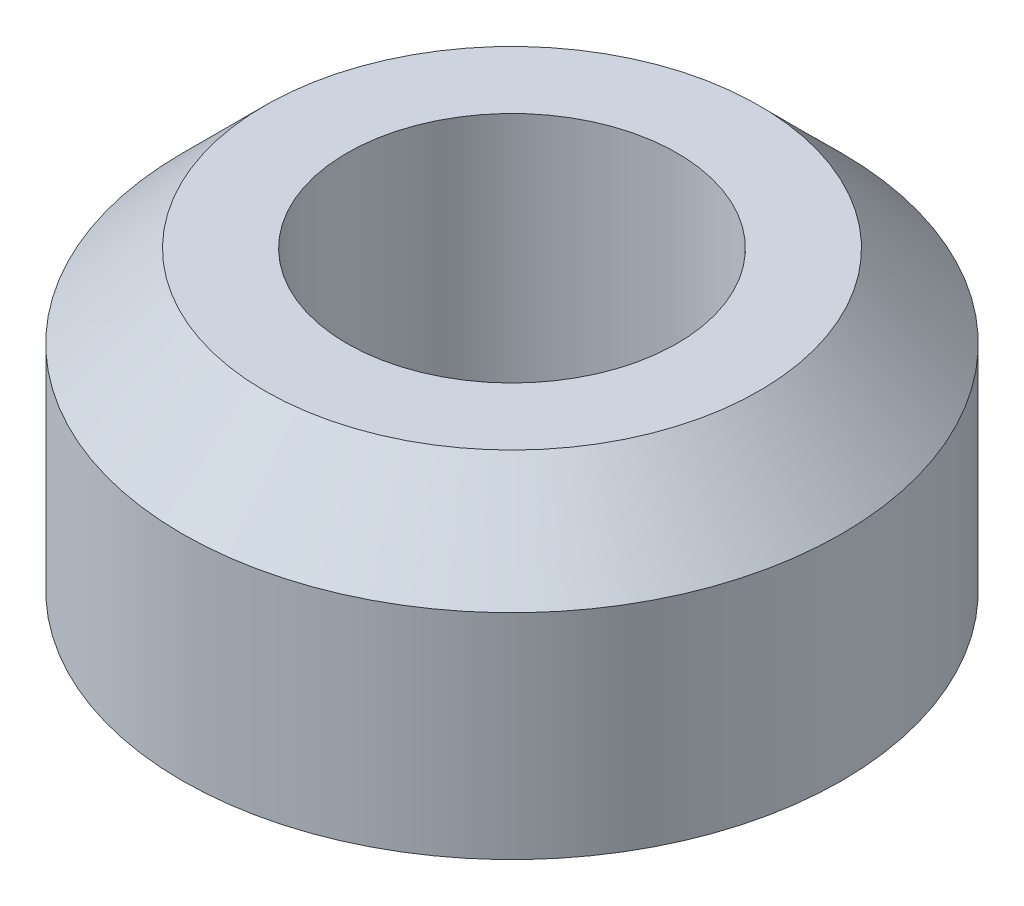
ISO-10303-21;
HEADER;
FILE_DESCRIPTION(('STEP AP214'),'2;1');
FILE_NAME('part.step','',(''),(''),'','','');
FILE_SCHEMA(('AUTOMOTIVE_DESIGN { 1 0 10303 214 1 1 1 1 }'));
ENDSEC;
DATA;
#1=APPLICATION_CONTEXT('core data for automotive mechanical design processes');
#2=APPLICATION_PROTOCOL_DEFINITION('international standard','automotive_design',2000,#1);
#3=PRODUCT_CONTEXT('',#1,'mechanical');
#4=PRODUCT('Part','Part','',(#3));
#5=PRODUCT_RELATED_PRODUCT_CATEGORY('part','',(#4));
#6=PRODUCT_DEFINITION_FORMATION('','',#4);
#7=PRODUCT_DEFINITION_CONTEXT('part definition',#1,'design');
#8=PRODUCT_DEFINITION('design','',#6,#7);
#9=PRODUCT_DEFINITION_SHAPE('','',#8);
#10=(LENGTH_UNIT() NAMED_UNIT(*) SI_UNIT(.MILLI.,.METRE.));
#11=(NAMED_UNIT(*) PLANE_ANGLE_UNIT() SI_UNIT($,.RADIAN.));
#12=(NAMED_UNIT(*) SI_UNIT($,.STERADIAN.) SOLID_ANGLE_UNIT());
#13=UNCERTAINTY_MEASURE_WITH_UNIT(LENGTH_MEASURE(1.E-05),#10,'distance_accuracy_value','');
#14=(GEOMETRIC_REPRESENTATION_CONTEXT(3) GLOBAL_UNCERTAINTY_ASSIGNED_CONTEXT((#13)) GLOBAL_UNIT_ASSIGNED_CONTEXT((#10,
#11,#12)) REPRESENTATION_CONTEXT('',''));
#15=CARTESIAN_POINT('',(0.,0.,0.));
#16=DIRECTION('',(0.,0.,1.));
#17=DIRECTION('',(1.,0.,0.));
#18=AXIS2_PLACEMENT_3D('',#15,#16,#17);
#19=CARTESIAN_POINT('',(0.,6.35,0.));
#20=DIRECTION('',(0.,1.,0.));
#21=DIRECTION('',(0.,0.,1.));
#22=AXIS2_PLACEMENT_3D('',#19,#20,#21);
#23=CYLINDRICAL_SURFACE('',#22,3.175);
#24=CARTESIAN_POINT('',(0.,6.025,0.));
#25=DIRECTION('',(0.,1.,0.));
#26=DIRECTION('',(0.,0.,1.));
#27=AXIS2_PLACEMENT_3D('',#24,#25,#26);
#28=CIRCLE('',#27,3.175);
#29=CARTESIAN_POINT('',(0.,6.025,3.175));
#30=VERTEX_POINT('',#29);
#31=EDGE_CURVE('E51',#30,#30,#28,.T.);
#32=ORIENTED_EDGE('',*,*,#31,.T.);
#33=EDGE_LOOP('',(#32));
#34=FACE_BOUND('',#33,.T.);
#35=CARTESIAN_POINT('',(0.,0.324999999999999,0.));
#36=DIRECTION('',(0.,1.,0.));
#37=DIRECTION('',(0.,0.,1.));
#38=AXIS2_PLACEMENT_3D('',#35,#36,#37);
#39=CIRCLE('',#38,3.175);
#40=CARTESIAN_POINT('',(0.,0.324999999999999,3.175));
#41=VERTEX_POINT('',#40);
#42=EDGE_CURVE('E10',#41,#41,#39,.T.);
#43=ORIENTED_EDGE('',*,*,#42,.F.);
#44=EDGE_LOOP('',(#43));
#45=FACE_BOUND('',#44,.T.);
#46=ADVANCED_FACE('F32',(#34,#45),#23,.F.);
#47=CARTESIAN_POINT('',(3.175,0.324999999999999,0.));
#48=DIRECTION('',(0.,1.,0.));
#49=DIRECTION('',(0.,0.,1.));
#50=AXIS2_PLACEMENT_3D('',#47,#48,#49);
#51=PLANE('',#50);
#52=CARTESIAN_POINT('',(0.,0.324999999999999,0.));
#53=DIRECTION('',(0.,1.,0.));
#54=DIRECTION('',(0.,0.,1.));
#55=AXIS2_PLACEMENT_3D('',#52,#53,#54);
#56=CIRCLE('',#55,6.34167761716093);
#57=CARTESIAN_POINT('',(0.,0.324999999999999,6.34167761716093));
#58=VERTEX_POINT('',#57);
#59=EDGE_CURVE('E38',#58,#58,#56,.T.);
#60=ORIENTED_EDGE('',*,*,#59,.F.);
#61=EDGE_LOOP('',(#60));
#62=FACE_BOUND('',#61,.T.);
#63=ORIENTED_EDGE('',*,*,#42,.T.);
#64=EDGE_LOOP('',(#63));
#65=FACE_BOUND('',#64,.T.);
#66=ADVANCED_FACE('F71',(#62,#65),#51,.F.);
#67=CARTESIAN_POINT('',(0.,6.35,0.));
#68=DIRECTION('',(0.,1.,0.));
#69=DIRECTION('',(0.,0.,1.));
#70=AXIS2_PLACEMENT_3D('',#67,#68,#69);
#71=CYLINDRICAL_SURFACE('',#70,6.34167761716093);
#72=CARTESIAN_POINT('',(0.,4.4375,0.));
#73=DIRECTION('',(0.,1.,0.));
#74=DIRECTION('',(0.,0.,1.));
#75=AXIS2_PLACEMENT_3D('',#72,#73,#74);
#76=CIRCLE('',#75,6.34167761716093);
#77=CARTESIAN_POINT('',(0.,4.4375,6.34167761716093));
#78=VERTEX_POINT('',#77);
#79=EDGE_CURVE('E42',#78,#78,#76,.T.);
#80=ORIENTED_EDGE('',*,*,#79,.F.);
#81=EDGE_LOOP('',(#80));
#82=FACE_BOUND('',#81,.T.);
#83=ORIENTED_EDGE('',*,*,#59,.T.);
#84=EDGE_LOOP('',(#83));
#85=FACE_BOUND('',#84,.T.);
#86=ADVANCED_FACE('F66',(#82,#85),#71,.T.);
#87=CARTESIAN_POINT('',(0.,4.4375,0.));
#88=DIRECTION('',(0.,-1.,0.));
#89=DIRECTION('',(0.,0.,-1.));
#90=AXIS2_PLACEMENT_3D('',#87,#88,#89);
#91=CONICAL_SURFACE('',#90,6.34167761716093,0.785398163397449);
#92=CARTESIAN_POINT('',(0.,6.025,0.));
#93=DIRECTION('',(0.,1.,0.));
#94=DIRECTION('',(0.,0.,1.));
#95=AXIS2_PLACEMENT_3D('',#92,#93,#94);
#96=CIRCLE('',#95,4.75417761716093);
#97=CARTESIAN_POINT('',(0.,6.025,4.75417761716093));
#98=VERTEX_POINT('',#97);
#99=EDGE_CURVE('E46',#98,#98,#96,.T.);
#100=ORIENTED_EDGE('',*,*,#99,.F.);
#101=EDGE_LOOP('',(#100));
#102=FACE_BOUND('',#101,.T.);
#103=ORIENTED_EDGE('',*,*,#79,.T.);
#104=EDGE_LOOP('',(#103));
#105=FACE_BOUND('',#104,.T.);
#106=ADVANCED_FACE('F60',(#102,#105),#91,.T.);
#107=CARTESIAN_POINT('',(4.75417761716093,6.025,0.));
#108=DIRECTION('',(0.,-1.,0.));
#109=DIRECTION('',(0.,0.,-1.));
#110=AXIS2_PLACEMENT_3D('',#107,#108,#109);
#111=PLANE('',#110);
#112=ORIENTED_EDGE('',*,*,#31,.F.);
#113=EDGE_LOOP('',(#112));
#114=FACE_BOUND('',#113,.T.);
#115=ORIENTED_EDGE('',*,*,#99,.T.);
#116=EDGE_LOOP('',(#115));
#117=FACE_BOUND('',#116,.T.);
#118=ADVANCED_FACE('F57',(#114,#117),#111,.F.);
#119=CLOSED_SHELL('',(#46,#66,#86,#106,#118));
#120=MANIFOLD_SOLID_BREP('B2',#119);
#121=ADVANCED_BREP_SHAPE_REPRESENTATION('',(#18,#120),#14);
#122=SHAPE_DEFINITION_REPRESENTATION(#9,#121);
ENDSEC;
END-ISO-10303-21;
